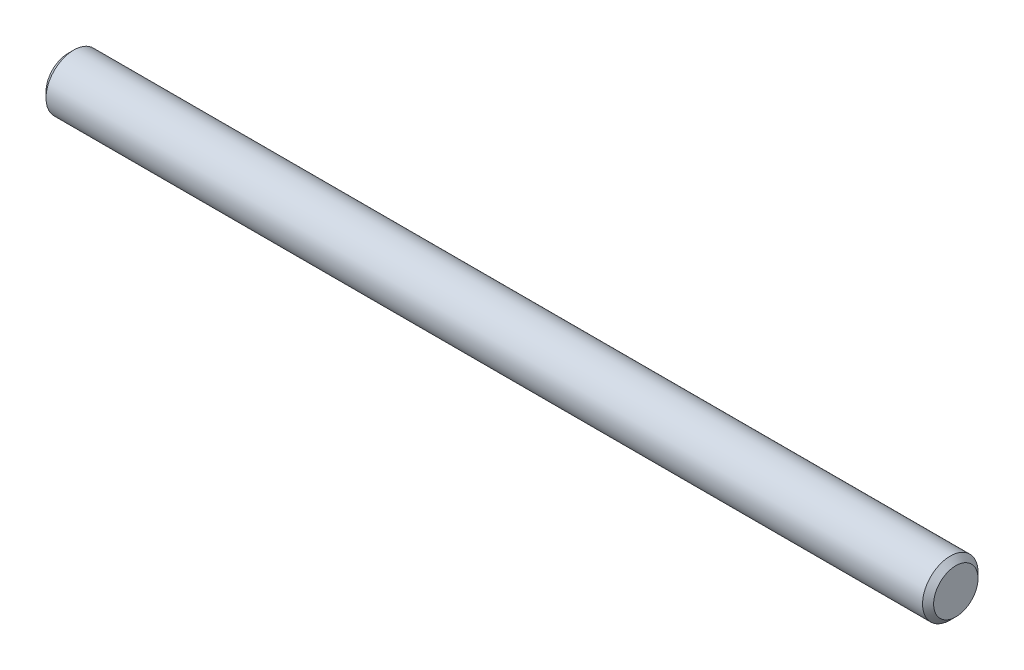
ISO-10303-21;
HEADER;
FILE_DESCRIPTION(('STEP AP214'),'2;1');
FILE_NAME('part.step','',(''),(''),'','','');
FILE_SCHEMA(('AUTOMOTIVE_DESIGN { 1 0 10303 214 1 1 1 1 }'));
ENDSEC;
DATA;
#1=APPLICATION_CONTEXT('core data for automotive mechanical design processes');
#2=APPLICATION_PROTOCOL_DEFINITION('international standard','automotive_design',2000,#1);
#3=PRODUCT_CONTEXT('',#1,'mechanical');
#4=PRODUCT('Part','Part','',(#3));
#5=PRODUCT_RELATED_PRODUCT_CATEGORY('part','',(#4));
#6=PRODUCT_DEFINITION_FORMATION('','',#4);
#7=PRODUCT_DEFINITION_CONTEXT('part definition',#1,'design');
#8=PRODUCT_DEFINITION('design','',#6,#7);
#9=PRODUCT_DEFINITION_SHAPE('','',#8);
#10=(LENGTH_UNIT() NAMED_UNIT(*) SI_UNIT(.MILLI.,.METRE.));
#11=(NAMED_UNIT(*) PLANE_ANGLE_UNIT() SI_UNIT($,.RADIAN.));
#12=(NAMED_UNIT(*) SI_UNIT($,.STERADIAN.) SOLID_ANGLE_UNIT());
#13=UNCERTAINTY_MEASURE_WITH_UNIT(LENGTH_MEASURE(1.E-05),#10,'distance_accuracy_value','');
#14=(GEOMETRIC_REPRESENTATION_CONTEXT(3) GLOBAL_UNCERTAINTY_ASSIGNED_CONTEXT((#13)) GLOBAL_UNIT_ASSIGNED_CONTEXT((#10,
#11,#12)) REPRESENTATION_CONTEXT('',''));
#15=CARTESIAN_POINT('',(0.,0.,0.));
#16=DIRECTION('',(0.,0.,1.));
#17=DIRECTION('',(1.,0.,0.));
#18=AXIS2_PLACEMENT_3D('',#15,#16,#17);
#19=CARTESIAN_POINT('',(-25.4,0.,0.));
#20=DIRECTION('',(1.,0.,0.));
#21=DIRECTION('',(0.,0.,-1.));
#22=AXIS2_PLACEMENT_3D('',#19,#20,#21);
#23=CYLINDRICAL_SURFACE('',#22,1.5875);
#24=CARTESIAN_POINT('',(25.0825,0.,0.));
#25=DIRECTION('',(1.,0.,0.));
#26=DIRECTION('',(0.,0.,-1.));
#27=AXIS2_PLACEMENT_3D('',#24,#25,#26);
#28=CIRCLE('',#27,1.5875);
#29=CARTESIAN_POINT('',(25.0825,0.,-1.5875));
#30=VERTEX_POINT('',#29);
#31=EDGE_CURVE('E56',#30,#30,#28,.F.);
#32=ORIENTED_EDGE('',*,*,#31,.T.);
#33=EDGE_LOOP('',(#32));
#34=FACE_BOUND('',#33,.T.);
#35=CARTESIAN_POINT('',(-25.0825,0.,0.));
#36=DIRECTION('',(1.,0.,0.));
#37=DIRECTION('',(0.,0.,-1.));
#38=AXIS2_PLACEMENT_3D('',#35,#36,#37);
#39=CIRCLE('',#38,1.5875);
#40=CARTESIAN_POINT('',(-25.0825,0.,-1.5875));
#41=VERTEX_POINT('',#40);
#42=EDGE_CURVE('E63',#41,#41,#39,.T.);
#43=ORIENTED_EDGE('',*,*,#42,.T.);
#44=EDGE_LOOP('',(#43));
#45=FACE_BOUND('',#44,.T.);
#46=ADVANCED_FACE('F48',(#34,#45),#23,.T.);
#47=CARTESIAN_POINT('',(-25.4,0.,0.));
#48=DIRECTION('',(1.,0.,0.));
#49=DIRECTION('',(0.,0.,-1.));
#50=AXIS2_PLACEMENT_3D('',#47,#48,#49);
#51=PLANE('',#50);
#52=CARTESIAN_POINT('',(-25.4,0.,0.));
#53=DIRECTION('',(1.,0.,0.));
#54=DIRECTION('',(0.,0.,-1.));
#55=AXIS2_PLACEMENT_3D('',#52,#53,#54);
#56=CIRCLE('',#55,1.26999999999999);
#57=CARTESIAN_POINT('',(-25.4,0.,-1.26999999999999));
#58=VERTEX_POINT('',#57);
#59=EDGE_CURVE('E12',#58,#58,#56,.F.);
#60=ORIENTED_EDGE('',*,*,#59,.T.);
#61=EDGE_LOOP('',(#60));
#62=FACE_BOUND('',#61,.T.);
#63=ADVANCED_FACE('F83',(#62),#51,.F.);
#64=CARTESIAN_POINT('',(25.4,0.,0.));
#65=DIRECTION('',(1.,0.,0.));
#66=DIRECTION('',(0.,0.,-1.));
#67=AXIS2_PLACEMENT_3D('',#64,#65,#66);
#68=PLANE('',#67);
#69=CARTESIAN_POINT('',(25.4,0.,0.));
#70=DIRECTION('',(1.,0.,0.));
#71=DIRECTION('',(0.,0.,-1.));
#72=AXIS2_PLACEMENT_3D('',#69,#70,#71);
#73=CIRCLE('',#72,1.26999999999999);
#74=CARTESIAN_POINT('',(25.4,0.,-1.26999999999999));
#75=VERTEX_POINT('',#74);
#76=EDGE_CURVE('E67',#75,#75,#73,.T.);
#77=ORIENTED_EDGE('',*,*,#76,.T.);
#78=EDGE_LOOP('',(#77));
#79=FACE_BOUND('',#78,.T.);
#80=ADVANCED_FACE('F73',(#79),#68,.T.);
#81=CARTESIAN_POINT('',(25.4,0.,0.));
#82=DIRECTION('',(-1.,0.,0.));
#83=DIRECTION('',(0.,0.,1.));
#84=AXIS2_PLACEMENT_3D('',#81,#82,#83);
#85=CONICAL_SURFACE('',#84,1.26999999999999,0.785398163397461);
#86=ORIENTED_EDGE('',*,*,#31,.F.);
#87=EDGE_LOOP('',(#86));
#88=FACE_BOUND('',#87,.T.);
#89=ORIENTED_EDGE('',*,*,#76,.F.);
#90=EDGE_LOOP('',(#89));
#91=FACE_BOUND('',#90,.T.);
#92=ADVANCED_FACE('F75',(#88,#91),#85,.T.);
#93=CARTESIAN_POINT('',(-25.0825,0.,0.));
#94=DIRECTION('',(1.,0.,0.));
#95=DIRECTION('',(0.,0.,-1.));
#96=AXIS2_PLACEMENT_3D('',#93,#94,#95);
#97=CONICAL_SURFACE('',#96,1.5875,0.78539816339745);
#98=ORIENTED_EDGE('',*,*,#59,.F.);
#99=EDGE_LOOP('',(#98));
#100=FACE_BOUND('',#99,.T.);
#101=ORIENTED_EDGE('',*,*,#42,.F.);
#102=EDGE_LOOP('',(#101));
#103=FACE_BOUND('',#102,.T.);
#104=ADVANCED_FACE('F50',(#100,#103),#97,.T.);
#105=CLOSED_SHELL('',(#46,#63,#80,#92,#104));
#106=MANIFOLD_SOLID_BREP('B2',#105);
#107=ADVANCED_BREP_SHAPE_REPRESENTATION('',(#18,#106),#14);
#108=SHAPE_DEFINITION_REPRESENTATION(#9,#107);
ENDSEC;
END-ISO-10303-21;
